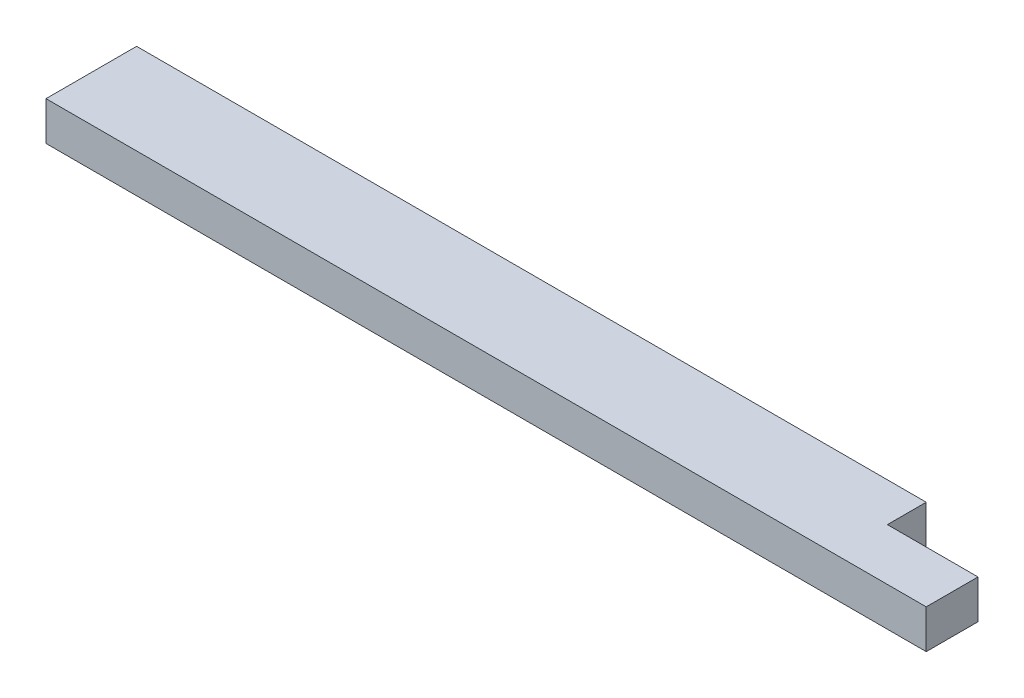
ISO-10303-21;
HEADER;
FILE_DESCRIPTION(('STEP AP214'),'2;1');
FILE_NAME('part.step','',(''),(''),'','','');
FILE_SCHEMA(('AUTOMOTIVE_DESIGN { 1 0 10303 214 1 1 1 1 }'));
ENDSEC;
DATA;
#1=APPLICATION_CONTEXT('core data for automotive mechanical design processes');
#2=APPLICATION_PROTOCOL_DEFINITION('international standard','automotive_design',2000,#1);
#3=PRODUCT_CONTEXT('',#1,'mechanical');
#4=PRODUCT('Part','Part','',(#3));
#5=PRODUCT_RELATED_PRODUCT_CATEGORY('part','',(#4));
#6=PRODUCT_DEFINITION_FORMATION('','',#4);
#7=PRODUCT_DEFINITION_CONTEXT('part definition',#1,'design');
#8=PRODUCT_DEFINITION('design','',#6,#7);
#9=PRODUCT_DEFINITION_SHAPE('','',#8);
#10=(LENGTH_UNIT() NAMED_UNIT(*) SI_UNIT(.MILLI.,.METRE.));
#11=(NAMED_UNIT(*) PLANE_ANGLE_UNIT() SI_UNIT($,.RADIAN.));
#12=(NAMED_UNIT(*) SI_UNIT($,.STERADIAN.) SOLID_ANGLE_UNIT());
#13=UNCERTAINTY_MEASURE_WITH_UNIT(LENGTH_MEASURE(1.E-05),#10,'distance_accuracy_value','');
#14=(GEOMETRIC_REPRESENTATION_CONTEXT(3) GLOBAL_UNCERTAINTY_ASSIGNED_CONTEXT((#13)) GLOBAL_UNIT_ASSIGNED_CONTEXT((#10,
#11,#12)) REPRESENTATION_CONTEXT('',''));
#15=CARTESIAN_POINT('',(0.,0.,0.));
#16=DIRECTION('',(0.,0.,1.));
#17=DIRECTION('',(1.,0.,0.));
#18=AXIS2_PLACEMENT_3D('',#15,#16,#17);
#19=CARTESIAN_POINT('',(0.,38.1,0.));
#20=DIRECTION('',(1.,0.,0.));
#21=DIRECTION('',(0.,0.,-1.));
#22=AXIS2_PLACEMENT_3D('',#19,#20,#21);
#23=PLANE('',#22);
#24=DIRECTION('',(0.,0.,1.));
#25=VECTOR('',#24,1.);
#26=CARTESIAN_POINT('',(0.,0.,0.));
#27=LINE('',#26,#25);
#28=CARTESIAN_POINT('',(0.,0.,-88.9));
#29=VERTEX_POINT('',#28);
#30=CARTESIAN_POINT('',(0.,0.,0.));
#31=VERTEX_POINT('',#30);
#32=EDGE_CURVE('E113',#29,#31,#27,.T.);
#33=ORIENTED_EDGE('',*,*,#32,.T.);
#34=DIRECTION('',(0.,-1.,0.));
#35=VECTOR('',#34,1.);
#36=CARTESIAN_POINT('',(0.,38.1,0.));
#37=LINE('',#36,#35);
#38=CARTESIAN_POINT('',(0.,38.1,0.));
#39=VERTEX_POINT('',#38);
#40=EDGE_CURVE('E11',#39,#31,#37,.T.);
#41=ORIENTED_EDGE('',*,*,#40,.F.);
#42=DIRECTION('',(0.,0.,1.));
#43=VECTOR('',#42,1.);
#44=CARTESIAN_POINT('',(0.,38.1,0.));
#45=LINE('',#44,#43);
#46=CARTESIAN_POINT('',(0.,38.1,-88.9));
#47=VERTEX_POINT('',#46);
#48=EDGE_CURVE('E114',#47,#39,#45,.T.);
#49=ORIENTED_EDGE('',*,*,#48,.F.);
#50=DIRECTION('',(0.,-1.,0.));
#51=VECTOR('',#50,1.);
#52=CARTESIAN_POINT('',(0.,38.1,-88.9));
#53=LINE('',#52,#51);
#54=EDGE_CURVE('E123',#47,#29,#53,.T.);
#55=ORIENTED_EDGE('',*,*,#54,.T.);
#56=EDGE_LOOP('',(#33,#41,#49,#55));
#57=FACE_BOUND('',#56,.T.);
#58=ADVANCED_FACE('F39',(#57),#23,.F.);
#59=CARTESIAN_POINT('',(0.,38.1,0.));
#60=DIRECTION('',(0.,0.,-1.));
#61=DIRECTION('',(-1.,0.,0.));
#62=AXIS2_PLACEMENT_3D('',#59,#60,#61);
#63=PLANE('',#62);
#64=DIRECTION('',(1.,0.,0.));
#65=VECTOR('',#64,1.);
#66=CARTESIAN_POINT('',(0.,0.,0.));
#67=LINE('',#66,#65);
#68=CARTESIAN_POINT('',(863.6,0.,0.));
#69=VERTEX_POINT('',#68);
#70=EDGE_CURVE('E119',#31,#69,#67,.T.);
#71=ORIENTED_EDGE('',*,*,#70,.T.);
#72=DIRECTION('',(0.,-1.,0.));
#73=VECTOR('',#72,1.);
#74=CARTESIAN_POINT('',(863.6,38.1,0.));
#75=LINE('',#74,#73);
#76=CARTESIAN_POINT('',(863.6,38.1,0.));
#77=VERTEX_POINT('',#76);
#78=EDGE_CURVE('E46',#77,#69,#75,.T.);
#79=ORIENTED_EDGE('',*,*,#78,.F.);
#80=DIRECTION('',(1.,0.,0.));
#81=VECTOR('',#80,1.);
#82=CARTESIAN_POINT('',(0.,38.1,0.));
#83=LINE('',#82,#81);
#84=EDGE_CURVE('E85',#39,#77,#83,.T.);
#85=ORIENTED_EDGE('',*,*,#84,.F.);
#86=ORIENTED_EDGE('',*,*,#40,.T.);
#87=EDGE_LOOP('',(#71,#79,#85,#86));
#88=FACE_BOUND('',#87,.T.);
#89=ADVANCED_FACE('F143',(#88),#63,.F.);
#90=CARTESIAN_POINT('',(863.6,38.1,0.));
#91=DIRECTION('',(-1.,0.,0.));
#92=DIRECTION('',(0.,0.,1.));
#93=AXIS2_PLACEMENT_3D('',#90,#91,#92);
#94=PLANE('',#93);
#95=DIRECTION('',(0.,0.,-1.));
#96=VECTOR('',#95,1.);
#97=CARTESIAN_POINT('',(863.6,0.,0.));
#98=LINE('',#97,#96);
#99=CARTESIAN_POINT('',(863.6,0.,-50.8));
#100=VERTEX_POINT('',#99);
#101=EDGE_CURVE('E115',#69,#100,#98,.T.);
#102=ORIENTED_EDGE('',*,*,#101,.T.);
#103=DIRECTION('',(0.,1.,0.));
#104=VECTOR('',#103,1.);
#105=CARTESIAN_POINT('',(863.6,0.,-50.8));
#106=LINE('',#105,#104);
#107=CARTESIAN_POINT('',(863.6,38.1,-50.8));
#108=VERTEX_POINT('',#107);
#109=EDGE_CURVE('E137',#100,#108,#106,.T.);
#110=ORIENTED_EDGE('',*,*,#109,.T.);
#111=DIRECTION('',(0.,0.,-1.));
#112=VECTOR('',#111,1.);
#113=CARTESIAN_POINT('',(863.6,38.1,0.));
#114=LINE('',#113,#112);
#115=EDGE_CURVE('E131',#77,#108,#114,.T.);
#116=ORIENTED_EDGE('',*,*,#115,.F.);
#117=ORIENTED_EDGE('',*,*,#78,.T.);
#118=EDGE_LOOP('',(#102,#110,#116,#117));
#119=FACE_BOUND('',#118,.T.);
#120=ADVANCED_FACE('F128',(#119),#94,.F.);
#121=CARTESIAN_POINT('',(0.,38.1,-88.9));
#122=DIRECTION('',(0.,0.,1.));
#123=DIRECTION('',(1.,0.,0.));
#124=AXIS2_PLACEMENT_3D('',#121,#122,#123);
#125=PLANE('',#124);
#126=DIRECTION('',(-1.,0.,0.));
#127=VECTOR('',#126,1.);
#128=CARTESIAN_POINT('',(0.,38.1,-88.9));
#129=LINE('',#128,#127);
#130=CARTESIAN_POINT('',(774.7,38.1,-88.9));
#131=VERTEX_POINT('',#130);
#132=EDGE_CURVE('E62',#131,#47,#129,.T.);
#133=ORIENTED_EDGE('',*,*,#132,.F.);
#134=DIRECTION('',(0.,1.,0.));
#135=VECTOR('',#134,1.);
#136=CARTESIAN_POINT('',(774.7,0.,-88.9));
#137=LINE('',#136,#135);
#138=CARTESIAN_POINT('',(774.7,0.,-88.9));
#139=VERTEX_POINT('',#138);
#140=EDGE_CURVE('E103',#139,#131,#137,.T.);
#141=ORIENTED_EDGE('',*,*,#140,.F.);
#142=DIRECTION('',(-1.,0.,0.));
#143=VECTOR('',#142,1.);
#144=CARTESIAN_POINT('',(0.,0.,-88.9));
#145=LINE('',#144,#143);
#146=EDGE_CURVE('E80',#139,#29,#145,.T.);
#147=ORIENTED_EDGE('',*,*,#146,.T.);
#148=ORIENTED_EDGE('',*,*,#54,.F.);
#149=EDGE_LOOP('',(#133,#141,#147,#148));
#150=FACE_BOUND('',#149,.T.);
#151=ADVANCED_FACE('F108',(#150),#125,.F.);
#152=CARTESIAN_POINT('',(0.,38.1,0.));
#153=DIRECTION('',(0.,-1.,0.));
#154=DIRECTION('',(0.,0.,-1.));
#155=AXIS2_PLACEMENT_3D('',#152,#153,#154);
#156=PLANE('',#155);
#157=ORIENTED_EDGE('',*,*,#115,.T.);
#158=DIRECTION('',(1.,0.,0.));
#159=VECTOR('',#158,1.);
#160=CARTESIAN_POINT('',(863.6,38.1,-50.8));
#161=LINE('',#160,#159);
#162=CARTESIAN_POINT('',(774.7,38.1,-50.8));
#163=VERTEX_POINT('',#162);
#164=EDGE_CURVE('E106',#163,#108,#161,.T.);
#165=ORIENTED_EDGE('',*,*,#164,.F.);
#166=DIRECTION('',(0.,0.,1.));
#167=VECTOR('',#166,1.);
#168=CARTESIAN_POINT('',(774.7,38.1,-88.9));
#169=LINE('',#168,#167);
#170=EDGE_CURVE('E134',#131,#163,#169,.T.);
#171=ORIENTED_EDGE('',*,*,#170,.F.);
#172=ORIENTED_EDGE('',*,*,#132,.T.);
#173=ORIENTED_EDGE('',*,*,#48,.T.);
#174=ORIENTED_EDGE('',*,*,#84,.T.);
#175=EDGE_LOOP('',(#157,#165,#171,#172,#173,#174));
#176=FACE_BOUND('',#175,.T.);
#177=ADVANCED_FACE('F147',(#176),#156,.F.);
#178=CARTESIAN_POINT('',(0.,0.,0.));
#179=DIRECTION('',(0.,-1.,0.));
#180=DIRECTION('',(0.,0.,-1.));
#181=AXIS2_PLACEMENT_3D('',#178,#179,#180);
#182=PLANE('',#181);
#183=DIRECTION('',(1.,0.,0.));
#184=VECTOR('',#183,1.);
#185=CARTESIAN_POINT('',(863.6,0.,-50.8));
#186=LINE('',#185,#184);
#187=CARTESIAN_POINT('',(774.7,0.,-50.8));
#188=VERTEX_POINT('',#187);
#189=EDGE_CURVE('E53',#188,#100,#186,.T.);
#190=ORIENTED_EDGE('',*,*,#189,.T.);
#191=ORIENTED_EDGE('',*,*,#101,.F.);
#192=ORIENTED_EDGE('',*,*,#70,.F.);
#193=ORIENTED_EDGE('',*,*,#32,.F.);
#194=ORIENTED_EDGE('',*,*,#146,.F.);
#195=DIRECTION('',(0.,0.,1.));
#196=VECTOR('',#195,1.);
#197=CARTESIAN_POINT('',(774.7,0.,-88.9));
#198=LINE('',#197,#196);
#199=EDGE_CURVE('E100',#139,#188,#198,.T.);
#200=ORIENTED_EDGE('',*,*,#199,.T.);
#201=EDGE_LOOP('',(#190,#191,#192,#193,#194,#200));
#202=FACE_BOUND('',#201,.T.);
#203=ADVANCED_FACE('F111',(#202),#182,.T.);
#204=CARTESIAN_POINT('',(863.6,0.,-50.8));
#205=DIRECTION('',(0.,0.,1.));
#206=DIRECTION('',(1.,0.,0.));
#207=AXIS2_PLACEMENT_3D('',#204,#205,#206);
#208=PLANE('',#207);
#209=ORIENTED_EDGE('',*,*,#164,.T.);
#210=ORIENTED_EDGE('',*,*,#109,.F.);
#211=ORIENTED_EDGE('',*,*,#189,.F.);
#212=DIRECTION('',(0.,1.,0.));
#213=VECTOR('',#212,1.);
#214=CARTESIAN_POINT('',(774.7,0.,-50.8));
#215=LINE('',#214,#213);
#216=EDGE_CURVE('E104',#188,#163,#215,.T.);
#217=ORIENTED_EDGE('',*,*,#216,.T.);
#218=EDGE_LOOP('',(#209,#210,#211,#217));
#219=FACE_BOUND('',#218,.T.);
#220=ADVANCED_FACE('F149',(#219),#208,.F.);
#221=CARTESIAN_POINT('',(774.7,0.,-88.9));
#222=DIRECTION('',(-1.,0.,0.));
#223=DIRECTION('',(0.,0.,1.));
#224=AXIS2_PLACEMENT_3D('',#221,#222,#223);
#225=PLANE('',#224);
#226=ORIENTED_EDGE('',*,*,#170,.T.);
#227=ORIENTED_EDGE('',*,*,#216,.F.);
#228=ORIENTED_EDGE('',*,*,#199,.F.);
#229=ORIENTED_EDGE('',*,*,#140,.T.);
#230=EDGE_LOOP('',(#226,#227,#228,#229));
#231=FACE_BOUND('',#230,.T.);
#232=ADVANCED_FACE('F102',(#231),#225,.F.);
#233=CLOSED_SHELL('',(#58,#89,#120,#151,#177,#203,#220,#232));
#234=MANIFOLD_SOLID_BREP('B2',#233);
#235=ADVANCED_BREP_SHAPE_REPRESENTATION('',(#18,#234),#14);
#236=SHAPE_DEFINITION_REPRESENTATION(#9,#235);
ENDSEC;
END-ISO-10303-21;
